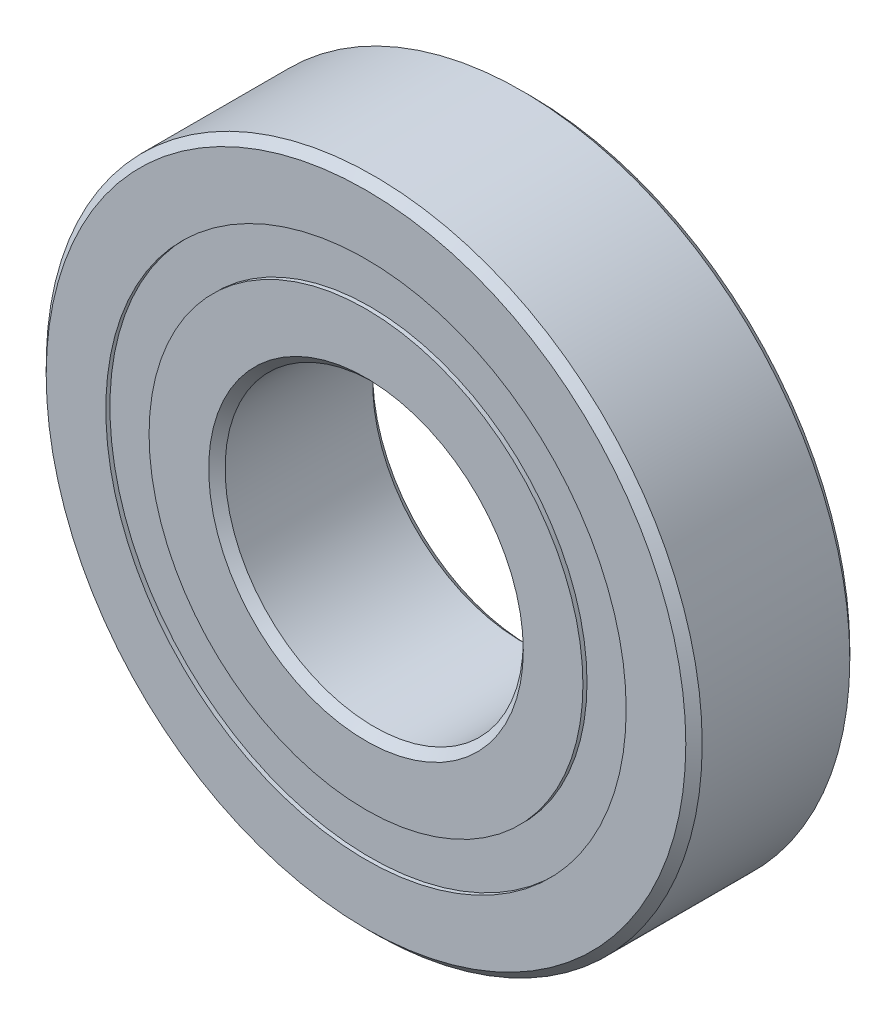
ISO-10303-21;
HEADER;
FILE_DESCRIPTION(('STEP AP214'),'2;1');
FILE_NAME('part.step','',(''),(''),'','','');
FILE_SCHEMA(('AUTOMOTIVE_DESIGN { 1 0 10303 214 1 1 1 1 }'));
ENDSEC;
DATA;
#1=APPLICATION_CONTEXT('core data for automotive mechanical design processes');
#2=APPLICATION_PROTOCOL_DEFINITION('international standard','automotive_design',2000,#1);
#3=PRODUCT_CONTEXT('',#1,'mechanical');
#4=PRODUCT('Part','Part','',(#3));
#5=PRODUCT_RELATED_PRODUCT_CATEGORY('part','',(#4));
#6=PRODUCT_DEFINITION_FORMATION('','',#4);
#7=PRODUCT_DEFINITION_CONTEXT('part definition',#1,'design');
#8=PRODUCT_DEFINITION('design','',#6,#7);
#9=PRODUCT_DEFINITION_SHAPE('','',#8);
#10=(LENGTH_UNIT() NAMED_UNIT(*) SI_UNIT(.MILLI.,.METRE.));
#11=(NAMED_UNIT(*) PLANE_ANGLE_UNIT() SI_UNIT($,.RADIAN.));
#12=(NAMED_UNIT(*) SI_UNIT($,.STERADIAN.) SOLID_ANGLE_UNIT());
#13=UNCERTAINTY_MEASURE_WITH_UNIT(LENGTH_MEASURE(1.E-05),#10,'distance_accuracy_value','');
#14=(GEOMETRIC_REPRESENTATION_CONTEXT(3) GLOBAL_UNCERTAINTY_ASSIGNED_CONTEXT((#13)) GLOBAL_UNIT_ASSIGNED_CONTEXT((#10,
#11,#12)) REPRESENTATION_CONTEXT('',''));
#15=CARTESIAN_POINT('',(0.,0.,0.));
#16=DIRECTION('',(0.,0.,1.));
#17=DIRECTION('',(1.,0.,0.));
#18=AXIS2_PLACEMENT_3D('',#15,#16,#17);
#19=CARTESIAN_POINT('',(0.,13.8513736263736,-4.14734375));
#20=DIRECTION('',(0.,0.,1.));
#21=DIRECTION('',(1.,0.,0.));
#22=AXIS2_PLACEMENT_3D('',#19,#20,#21);
#23=PLANE('',#22);
#24=CARTESIAN_POINT('',(0.,0.,-4.14734375));
#25=DIRECTION('',(0.,0.,1.));
#26=DIRECTION('',(1.,0.,0.));
#27=AXIS2_PLACEMENT_3D('',#24,#25,#26);
#28=CIRCLE('',#27,13.8513736263736);
#29=CARTESIAN_POINT('',(13.8513736263736,0.,-4.14734375));
#30=VERTEX_POINT('',#29);
#31=EDGE_CURVE('E60',#30,#30,#28,.T.);
#32=ORIENTED_EDGE('',*,*,#31,.F.);
#33=EDGE_LOOP('',(#32));
#34=FACE_BOUND('',#33,.T.);
#35=CARTESIAN_POINT('',(0.,0.,-4.14734375));
#36=DIRECTION('',(0.,0.,1.));
#37=DIRECTION('',(1.,0.,0.));
#38=AXIS2_PLACEMENT_3D('',#35,#36,#37);
#39=CIRCLE('',#38,11.5486263736264);
#40=CARTESIAN_POINT('',(11.5486263736264,0.,-4.14734375));
#41=VERTEX_POINT('',#40);
#42=EDGE_CURVE('E11',#41,#41,#39,.T.);
#43=ORIENTED_EDGE('',*,*,#42,.T.);
#44=EDGE_LOOP('',(#43));
#45=FACE_BOUND('',#44,.T.);
#46=ADVANCED_FACE('F46',(#34,#45),#23,.F.);
#47=CARTESIAN_POINT('',(0.,0.,4.365625));
#48=DIRECTION('',(0.,0.,1.));
#49=DIRECTION('',(1.,0.,0.));
#50=AXIS2_PLACEMENT_3D('',#47,#48,#49);
#51=CYLINDRICAL_SURFACE('',#50,11.5486263736264);
#52=ORIENTED_EDGE('',*,*,#42,.F.);
#53=EDGE_LOOP('',(#52));
#54=FACE_BOUND('',#53,.T.);
#55=CARTESIAN_POINT('',(0.,0.,-2.25617798111032));
#56=DIRECTION('',(0.,0.,1.));
#57=DIRECTION('',(1.,0.,0.));
#58=AXIS2_PLACEMENT_3D('',#55,#56,#57);
#59=CIRCLE('',#58,11.5486263736264);
#60=CARTESIAN_POINT('',(11.5486263736264,0.,-2.25617798111032));
#61=VERTEX_POINT('',#60);
#62=EDGE_CURVE('E52',#61,#61,#59,.T.);
#63=ORIENTED_EDGE('',*,*,#62,.T.);
#64=EDGE_LOOP('',(#63));
#65=FACE_BOUND('',#64,.T.);
#66=ADVANCED_FACE('F69',(#54,#65),#51,.F.);
#67=CARTESIAN_POINT('',(0.,13.8513736263736,-2.25617798111032));
#68=DIRECTION('',(0.,0.,-1.));
#69=DIRECTION('',(-1.,0.,0.));
#70=AXIS2_PLACEMENT_3D('',#67,#68,#69);
#71=PLANE('',#70);
#72=ORIENTED_EDGE('',*,*,#62,.F.);
#73=EDGE_LOOP('',(#72));
#74=FACE_BOUND('',#73,.T.);
#75=CARTESIAN_POINT('',(0.,0.,-2.25617798111032));
#76=DIRECTION('',(0.,0.,1.));
#77=DIRECTION('',(1.,0.,0.));
#78=AXIS2_PLACEMENT_3D('',#75,#76,#77);
#79=CIRCLE('',#78,13.8513736263736);
#80=CARTESIAN_POINT('',(13.8513736263736,0.,-2.25617798111032));
#81=VERTEX_POINT('',#80);
#82=EDGE_CURVE('E56',#81,#81,#79,.T.);
#83=ORIENTED_EDGE('',*,*,#82,.T.);
#84=EDGE_LOOP('',(#83));
#85=FACE_BOUND('',#84,.T.);
#86=ADVANCED_FACE('F73',(#74,#85),#71,.F.);
#87=CARTESIAN_POINT('',(0.,0.,4.365625));
#88=DIRECTION('',(0.,0.,1.));
#89=DIRECTION('',(1.,0.,0.));
#90=AXIS2_PLACEMENT_3D('',#87,#88,#89);
#91=CYLINDRICAL_SURFACE('',#90,13.8513736263736);
#92=ORIENTED_EDGE('',*,*,#82,.F.);
#93=EDGE_LOOP('',(#92));
#94=FACE_BOUND('',#93,.T.);
#95=ORIENTED_EDGE('',*,*,#31,.T.);
#96=EDGE_LOOP('',(#95));
#97=FACE_BOUND('',#96,.T.);
#98=ADVANCED_FACE('F66',(#94,#97),#91,.T.);
#99=CLOSED_SHELL('',(#46,#66,#86,#98));
#100=MANIFOLD_SOLID_BREP('B2',#99);
#101=CARTESIAN_POINT('',(0.,13.8513736263736,4.14734375));
#102=DIRECTION('',(0.,0.,-1.));
#103=DIRECTION('',(-1.,0.,0.));
#104=AXIS2_PLACEMENT_3D('',#101,#102,#103);
#105=PLANE('',#104);
#106=CARTESIAN_POINT('',(0.,0.,4.14734375));
#107=DIRECTION('',(0.,0.,1.));
#108=DIRECTION('',(1.,0.,0.));
#109=AXIS2_PLACEMENT_3D('',#106,#107,#108);
#110=CIRCLE('',#109,11.5486263736264);
#111=CARTESIAN_POINT('',(11.5486263736264,0.,4.14734375));
#112=VERTEX_POINT('',#111);
#113=EDGE_CURVE('E45',#112,#112,#110,.T.);
#114=ORIENTED_EDGE('',*,*,#113,.F.);
#115=EDGE_LOOP('',(#114));
#116=FACE_BOUND('',#115,.T.);
#117=CARTESIAN_POINT('',(0.,0.,4.14734375));
#118=DIRECTION('',(0.,0.,1.));
#119=DIRECTION('',(1.,0.,0.));
#120=AXIS2_PLACEMENT_3D('',#117,#118,#119);
#121=CIRCLE('',#120,13.8513736263736);
#122=CARTESIAN_POINT('',(13.8513736263736,0.,4.14734375));
#123=VERTEX_POINT('',#122);
#124=EDGE_CURVE('E128',#123,#123,#121,.T.);
#125=ORIENTED_EDGE('',*,*,#124,.T.);
#126=EDGE_LOOP('',(#125));
#127=FACE_BOUND('',#126,.T.);
#128=ADVANCED_FACE('F114',(#116,#127),#105,.F.);
#129=CARTESIAN_POINT('',(0.,0.,4.365625));
#130=DIRECTION('',(0.,0.,1.));
#131=DIRECTION('',(1.,0.,0.));
#132=AXIS2_PLACEMENT_3D('',#129,#130,#131);
#133=CYLINDRICAL_SURFACE('',#132,11.5486263736264);
#134=CARTESIAN_POINT('',(0.,0.,2.25617798111032));
#135=DIRECTION('',(0.,0.,1.));
#136=DIRECTION('',(1.,0.,0.));
#137=AXIS2_PLACEMENT_3D('',#134,#135,#136);
#138=CIRCLE('',#137,11.5486263736264);
#139=CARTESIAN_POINT('',(11.5486263736264,0.,2.25617798111032));
#140=VERTEX_POINT('',#139);
#141=EDGE_CURVE('E120',#140,#140,#138,.T.);
#142=ORIENTED_EDGE('',*,*,#141,.F.);
#143=EDGE_LOOP('',(#142));
#144=FACE_BOUND('',#143,.T.);
#145=ORIENTED_EDGE('',*,*,#113,.T.);
#146=EDGE_LOOP('',(#145));
#147=FACE_BOUND('',#146,.T.);
#148=ADVANCED_FACE('F143',(#144,#147),#133,.F.);
#149=CARTESIAN_POINT('',(0.,13.8513736263736,2.25617798111032));
#150=DIRECTION('',(0.,0.,1.));
#151=DIRECTION('',(1.,0.,0.));
#152=AXIS2_PLACEMENT_3D('',#149,#150,#151);
#153=PLANE('',#152);
#154=CARTESIAN_POINT('',(0.,0.,2.25617798111032));
#155=DIRECTION('',(0.,0.,1.));
#156=DIRECTION('',(1.,0.,0.));
#157=AXIS2_PLACEMENT_3D('',#154,#155,#156);
#158=CIRCLE('',#157,13.8513736263736);
#159=CARTESIAN_POINT('',(13.8513736263736,0.,2.25617798111032));
#160=VERTEX_POINT('',#159);
#161=EDGE_CURVE('E124',#160,#160,#158,.T.);
#162=ORIENTED_EDGE('',*,*,#161,.F.);
#163=EDGE_LOOP('',(#162));
#164=FACE_BOUND('',#163,.T.);
#165=ORIENTED_EDGE('',*,*,#141,.T.);
#166=EDGE_LOOP('',(#165));
#167=FACE_BOUND('',#166,.T.);
#168=ADVANCED_FACE('F138',(#164,#167),#153,.F.);
#169=CARTESIAN_POINT('',(0.,0.,4.365625));
#170=DIRECTION('',(0.,0.,1.));
#171=DIRECTION('',(1.,0.,0.));
#172=AXIS2_PLACEMENT_3D('',#169,#170,#171);
#173=CYLINDRICAL_SURFACE('',#172,13.8513736263736);
#174=ORIENTED_EDGE('',*,*,#124,.F.);
#175=EDGE_LOOP('',(#174));
#176=FACE_BOUND('',#175,.T.);
#177=ORIENTED_EDGE('',*,*,#161,.T.);
#178=EDGE_LOOP('',(#177));
#179=FACE_BOUND('',#178,.T.);
#180=ADVANCED_FACE('F135',(#176,#179),#173,.T.);
#181=CLOSED_SHELL('',(#128,#148,#168,#180));
#182=MANIFOLD_SOLID_BREP('B6',#181);
#183=CARTESIAN_POINT('',(-7.46487270411427,10.2745158285619,0.));
#184=DIRECTION('',(0.,0.,1.));
#185=DIRECTION('',(-0.587785252292462,0.809016994374955,0.));
#186=AXIS2_PLACEMENT_3D('',#183,#184,#185);
#187=SPHERICAL_SURFACE('',#186,2.25617798111032);
#188=CARTESIAN_POINT('',(-7.46487270411427,10.2745158285619,2.25617798111032));
#189=VERTEX_POINT('',#188);
#190=VERTEX_LOOP('',#189);
#191=FACE_BOUND('',#190,.T.);
#192=ADVANCED_FACE('F181',(#191),#187,.T.);
#193=CLOSED_SHELL('',(#192));
#194=MANIFOLD_SOLID_BREP('B40',#193);
#195=CARTESIAN_POINT('',(-12.0784177569484,3.92451582856197,0.));
#196=DIRECTION('',(0.,0.,1.));
#197=DIRECTION('',(-0.95105651629515,0.309016994374958,0.));
#198=AXIS2_PLACEMENT_3D('',#195,#196,#197);
#199=SPHERICAL_SURFACE('',#198,2.25617798111032);
#200=CARTESIAN_POINT('',(-12.0784177569484,3.92451582856197,2.25617798111032));
#201=VERTEX_POINT('',#200);
#202=VERTEX_LOOP('',#201);
#203=FACE_BOUND('',#202,.T.);
#204=ADVANCED_FACE('F201',(#203),#199,.T.);
#205=CLOSED_SHELL('',(#204));
#206=MANIFOLD_SOLID_BREP('B110',#205);
#207=CARTESIAN_POINT('',(-12.0784177569485,-3.92451582856172,0.));
#208=DIRECTION('',(0.,0.,1.));
#209=DIRECTION('',(-0.951056516295157,-0.309016994374938,0.));
#210=AXIS2_PLACEMENT_3D('',#207,#208,#209);
#211=SPHERICAL_SURFACE('',#210,2.25617798111032);
#212=CARTESIAN_POINT('',(-12.0784177569485,-3.92451582856172,2.25617798111032));
#213=VERTEX_POINT('',#212);
#214=VERTEX_LOOP('',#213);
#215=FACE_BOUND('',#214,.T.);
#216=ADVANCED_FACE('F221',(#215),#211,.T.);
#217=CLOSED_SHELL('',(#216));
#218=MANIFOLD_SOLID_BREP('B177',#217);
#219=CARTESIAN_POINT('',(-7.4648727041145,-10.2745158285618,0.));
#220=DIRECTION('',(0.,0.,1.));
#221=DIRECTION('',(-0.58778525229248,-0.809016994374942,0.));
#222=AXIS2_PLACEMENT_3D('',#219,#220,#221);
#223=SPHERICAL_SURFACE('',#222,2.25617798111032);
#224=CARTESIAN_POINT('',(-7.4648727041145,-10.2745158285618,2.25617798111032));
#225=VERTEX_POINT('',#224);
#226=VERTEX_LOOP('',#225);
#227=FACE_BOUND('',#226,.T.);
#228=ADVANCED_FACE('F241',(#227),#223,.T.);
#229=CLOSED_SHELL('',(#228));
#230=MANIFOLD_SOLID_BREP('B197',#229);
#231=CARTESIAN_POINT('',(0.,-12.7,0.));
#232=DIRECTION('',(0.,0.,1.));
#233=DIRECTION('',(0.,-1.,0.));
#234=AXIS2_PLACEMENT_3D('',#231,#232,#233);
#235=SPHERICAL_SURFACE('',#234,2.25617798111032);
#236=CARTESIAN_POINT('',(0.,-12.7,2.25617798111032));
#237=VERTEX_POINT('',#236);
#238=VERTEX_LOOP('',#237);
#239=FACE_BOUND('',#238,.T.);
#240=ADVANCED_FACE('F261',(#239),#235,.T.);
#241=CLOSED_SHELL('',(#240));
#242=MANIFOLD_SOLID_BREP('B217',#241);
#243=CARTESIAN_POINT('',(7.46487270411435,-10.2745158285619,0.));
#244=DIRECTION('',(0.,0.,1.));
#245=DIRECTION('',(0.587785252292469,-0.809016994374951,0.));
#246=AXIS2_PLACEMENT_3D('',#243,#244,#245);
#247=SPHERICAL_SURFACE('',#246,2.25617798111032);
#248=CARTESIAN_POINT('',(7.46487270411435,-10.2745158285619,2.25617798111032));
#249=VERTEX_POINT('',#248);
#250=VERTEX_LOOP('',#249);
#251=FACE_BOUND('',#250,.T.);
#252=ADVANCED_FACE('F281',(#251),#247,.T.);
#253=CLOSED_SHELL('',(#252));
#254=MANIFOLD_SOLID_BREP('B237',#253);
#255=CARTESIAN_POINT('',(12.0784177569484,-3.92451582856189,0.));
#256=DIRECTION('',(0.,0.,1.));
#257=DIRECTION('',(0.951056516295152,-0.309016994374952,0.));
#258=AXIS2_PLACEMENT_3D('',#255,#256,#257);
#259=SPHERICAL_SURFACE('',#258,2.25617798111032);
#260=CARTESIAN_POINT('',(12.0784177569484,-3.92451582856189,2.25617798111032));
#261=VERTEX_POINT('',#260);
#262=VERTEX_LOOP('',#261);
#263=FACE_BOUND('',#262,.T.);
#264=ADVANCED_FACE('F301',(#263),#259,.T.);
#265=CLOSED_SHELL('',(#264));
#266=MANIFOLD_SOLID_BREP('B257',#265);
#267=CARTESIAN_POINT('',(12.0784177569485,3.9245158285618,0.));
#268=DIRECTION('',(0.,0.,1.));
#269=DIRECTION('',(0.951056516295155,0.309016994374945,0.));
#270=AXIS2_PLACEMENT_3D('',#267,#268,#269);
#271=SPHERICAL_SURFACE('',#270,2.25617798111032);
#272=CARTESIAN_POINT('',(12.0784177569485,3.9245158285618,2.25617798111032));
#273=VERTEX_POINT('',#272);
#274=VERTEX_LOOP('',#273);
#275=FACE_BOUND('',#274,.T.);
#276=ADVANCED_FACE('F321',(#275),#271,.T.);
#277=CLOSED_SHELL('',(#276));
#278=MANIFOLD_SOLID_BREP('B277',#277);
#279=CARTESIAN_POINT('',(7.46487270411442,10.2745158285618,0.));
#280=DIRECTION('',(0.,0.,1.));
#281=DIRECTION('',(0.587785252292474,0.809016994374947,0.));
#282=AXIS2_PLACEMENT_3D('',#279,#280,#281);
#283=SPHERICAL_SURFACE('',#282,2.25617798111032);
#284=CARTESIAN_POINT('',(7.46487270411442,10.2745158285618,2.25617798111032));
#285=VERTEX_POINT('',#284);
#286=VERTEX_LOOP('',#285);
#287=FACE_BOUND('',#286,.T.);
#288=ADVANCED_FACE('F341',(#287),#283,.T.);
#289=CLOSED_SHELL('',(#288));
#290=MANIFOLD_SOLID_BREP('B297',#289);
#291=CARTESIAN_POINT('',(0.,12.7,0.));
#292=DIRECTION('',(0.,0.,1.));
#293=DIRECTION('',(0.,1.,0.));
#294=AXIS2_PLACEMENT_3D('',#291,#292,#293);
#295=SPHERICAL_SURFACE('',#294,2.25617798111032);
#296=CARTESIAN_POINT('',(0.,12.7,2.25617798111032));
#297=VERTEX_POINT('',#296);
#298=VERTEX_LOOP('',#297);
#299=FACE_BOUND('',#298,.T.);
#300=ADVANCED_FACE('F364',(#299),#295,.T.);
#301=CLOSED_SHELL('',(#300));
#302=MANIFOLD_SOLID_BREP('B317',#301);
#303=CARTESIAN_POINT('',(0.,11.5486263736264,4.365625));
#304=DIRECTION('',(0.,0.,-1.));
#305=DIRECTION('',(-1.,0.,0.));
#306=AXIS2_PLACEMENT_3D('',#303,#304,#305);
#307=PLANE('',#306);
#308=CARTESIAN_POINT('',(0.,0.,4.365625));
#309=DIRECTION('',(0.,0.,1.));
#310=DIRECTION('',(1.,0.,0.));
#311=AXIS2_PLACEMENT_3D('',#308,#309,#310);
#312=CIRCLE('',#311,8.3740625);
#313=CARTESIAN_POINT('',(8.3740625,0.,4.365625));
#314=VERTEX_POINT('',#313);
#315=EDGE_CURVE('E412',#314,#314,#312,.T.);
#316=ORIENTED_EDGE('',*,*,#315,.F.);
#317=EDGE_LOOP('',(#316));
#318=FACE_BOUND('',#317,.T.);
#319=CARTESIAN_POINT('',(0.,0.,4.365625));
#320=DIRECTION('',(0.,0.,1.));
#321=DIRECTION('',(1.,0.,0.));
#322=AXIS2_PLACEMENT_3D('',#319,#320,#321);
#323=CIRCLE('',#322,11.5486263736264);
#324=CARTESIAN_POINT('',(11.5486263736264,0.,4.365625));
#325=VERTEX_POINT('',#324);
#326=EDGE_CURVE('E363',#325,#325,#323,.T.);
#327=ORIENTED_EDGE('',*,*,#326,.T.);
#328=EDGE_LOOP('',(#327));
#329=FACE_BOUND('',#328,.T.);
#330=ADVANCED_FACE('F384',(#318,#329),#307,.F.);
#331=CARTESIAN_POINT('',(0.,0.,4.365625));
#332=DIRECTION('',(0.,0.,1.));
#333=DIRECTION('',(1.,0.,0.));
#334=AXIS2_PLACEMENT_3D('',#331,#332,#333);
#335=CYLINDRICAL_SURFACE('',#334,11.5486263736264);
#336=ORIENTED_EDGE('',*,*,#326,.F.);
#337=EDGE_LOOP('',(#336));
#338=FACE_BOUND('',#337,.T.);
#339=CARTESIAN_POINT('',(0.,0.,1.94027777777778));
#340=DIRECTION('',(0.,0.,1.));
#341=DIRECTION('',(1.,0.,0.));
#342=AXIS2_PLACEMENT_3D('',#339,#340,#341);
#343=CIRCLE('',#342,11.5486263736264);
#344=CARTESIAN_POINT('',(11.5486263736264,0.,1.94027777777778));
#345=VERTEX_POINT('',#344);
#346=EDGE_CURVE('E390',#345,#345,#343,.T.);
#347=ORIENTED_EDGE('',*,*,#346,.T.);
#348=EDGE_LOOP('',(#347));
#349=FACE_BOUND('',#348,.T.);
#350=ADVANCED_FACE('F419',(#338,#349),#335,.T.);
#351=CARTESIAN_POINT('',(0.,0.,0.));
#352=DIRECTION('',(0.,0.,1.));
#353=DIRECTION('',(1.,0.,0.));
#354=AXIS2_PLACEMENT_3D('',#351,#352,#353);
#355=TOROIDAL_SURFACE('',#354,12.7,2.25617798111031);
#356=ORIENTED_EDGE('',*,*,#346,.F.);
#357=EDGE_LOOP('',(#356));
#358=FACE_BOUND('',#357,.T.);
#359=CARTESIAN_POINT('',(0.,0.,-1.94027777777778));
#360=DIRECTION('',(0.,0.,1.));
#361=DIRECTION('',(1.,0.,0.));
#362=AXIS2_PLACEMENT_3D('',#359,#360,#361);
#363=CIRCLE('',#362,11.5486263736264);
#364=CARTESIAN_POINT('',(11.5486263736264,0.,-1.94027777777778));
#365=VERTEX_POINT('',#364);
#366=EDGE_CURVE('E394',#365,#365,#363,.T.);
#367=ORIENTED_EDGE('',*,*,#366,.T.);
#368=EDGE_LOOP('',(#367));
#369=FACE_BOUND('',#368,.T.);
#370=ADVANCED_FACE('F423',(#358,#369),#355,.F.);
#371=CARTESIAN_POINT('',(0.,0.,4.365625));
#372=DIRECTION('',(0.,0.,1.));
#373=DIRECTION('',(1.,0.,0.));
#374=AXIS2_PLACEMENT_3D('',#371,#372,#373);
#375=CYLINDRICAL_SURFACE('',#374,11.5486263736264);
#376=ORIENTED_EDGE('',*,*,#366,.F.);
#377=EDGE_LOOP('',(#376));
#378=FACE_BOUND('',#377,.T.);
#379=CARTESIAN_POINT('',(0.,0.,-4.365625));
#380=DIRECTION('',(0.,0.,1.));
#381=DIRECTION('',(1.,0.,0.));
#382=AXIS2_PLACEMENT_3D('',#379,#380,#381);
#383=CIRCLE('',#382,11.5486263736264);
#384=CARTESIAN_POINT('',(11.5486263736264,0.,-4.365625));
#385=VERTEX_POINT('',#384);
#386=EDGE_CURVE('E398',#385,#385,#383,.T.);
#387=ORIENTED_EDGE('',*,*,#386,.T.);
#388=EDGE_LOOP('',(#387));
#389=FACE_BOUND('',#388,.T.);
#390=ADVANCED_FACE('F428',(#378,#389),#375,.T.);
#391=CARTESIAN_POINT('',(0.,8.3740625,-4.365625));
#392=DIRECTION('',(0.,0.,1.));
#393=DIRECTION('',(1.,0.,0.));
#394=AXIS2_PLACEMENT_3D('',#391,#392,#393);
#395=PLANE('',#394);
#396=ORIENTED_EDGE('',*,*,#386,.F.);
#397=EDGE_LOOP('',(#396));
#398=FACE_BOUND('',#397,.T.);
#399=CARTESIAN_POINT('',(0.,0.,-4.365625));
#400=DIRECTION('',(0.,0.,1.));
#401=DIRECTION('',(1.,0.,0.));
#402=AXIS2_PLACEMENT_3D('',#399,#400,#401);
#403=CIRCLE('',#402,8.3740625);
#404=CARTESIAN_POINT('',(8.3740625,0.,-4.365625));
#405=VERTEX_POINT('',#404);
#406=EDGE_CURVE('E403',#405,#405,#403,.T.);
#407=ORIENTED_EDGE('',*,*,#406,.T.);
#408=EDGE_LOOP('',(#407));
#409=FACE_BOUND('',#408,.T.);
#410=ADVANCED_FACE('F434',(#398,#409),#395,.F.);
#411=CARTESIAN_POINT('',(0.,0.,-3.9290625));
#412=DIRECTION('',(0.,0.,-1.));
#413=DIRECTION('',(-1.,0.,0.));
#414=AXIS2_PLACEMENT_3D('',#411,#412,#413);
#415=CONICAL_SURFACE('',#414,7.9375,0.785398163397446);
#416=ORIENTED_EDGE('',*,*,#406,.F.);
#417=EDGE_LOOP('',(#416));
#418=FACE_BOUND('',#417,.T.);
#419=CARTESIAN_POINT('',(0.,0.,-3.9290625));
#420=DIRECTION('',(0.,0.,1.));
#421=DIRECTION('',(1.,0.,0.));
#422=AXIS2_PLACEMENT_3D('',#419,#420,#421);
#423=CIRCLE('',#422,7.9375);
#424=CARTESIAN_POINT('',(7.9375,0.,-3.9290625));
#425=VERTEX_POINT('',#424);
#426=EDGE_CURVE('E406',#425,#425,#423,.T.);
#427=ORIENTED_EDGE('',*,*,#426,.T.);
#428=EDGE_LOOP('',(#427));
#429=FACE_BOUND('',#428,.T.);
#430=ADVANCED_FACE('F438',(#418,#429),#415,.F.);
#431=CARTESIAN_POINT('',(0.,0.,4.365625));
#432=DIRECTION('',(0.,0.,1.));
#433=DIRECTION('',(1.,0.,0.));
#434=AXIS2_PLACEMENT_3D('',#431,#432,#433);
#435=CYLINDRICAL_SURFACE('',#434,7.9375);
#436=ORIENTED_EDGE('',*,*,#426,.F.);
#437=EDGE_LOOP('',(#436));
#438=FACE_BOUND('',#437,.T.);
#439=CARTESIAN_POINT('',(0.,0.,3.9290625));
#440=DIRECTION('',(0.,0.,1.));
#441=DIRECTION('',(1.,0.,0.));
#442=AXIS2_PLACEMENT_3D('',#439,#440,#441);
#443=CIRCLE('',#442,7.9375);
#444=CARTESIAN_POINT('',(7.9375,0.,3.9290625));
#445=VERTEX_POINT('',#444);
#446=EDGE_CURVE('E409',#445,#445,#443,.T.);
#447=ORIENTED_EDGE('',*,*,#446,.T.);
#448=EDGE_LOOP('',(#447));
#449=FACE_BOUND('',#448,.T.);
#450=ADVANCED_FACE('F442',(#438,#449),#435,.F.);
#451=CARTESIAN_POINT('',(0.,0.,4.365625));
#452=DIRECTION('',(0.,0.,1.));
#453=DIRECTION('',(1.,0.,0.));
#454=AXIS2_PLACEMENT_3D('',#451,#452,#453);
#455=CONICAL_SURFACE('',#454,8.3740625,0.78539816339745);
#456=ORIENTED_EDGE('',*,*,#446,.F.);
#457=EDGE_LOOP('',(#456));
#458=FACE_BOUND('',#457,.T.);
#459=ORIENTED_EDGE('',*,*,#315,.T.);
#460=EDGE_LOOP('',(#459));
#461=FACE_BOUND('',#460,.T.);
#462=ADVANCED_FACE('F416',(#458,#461),#455,.F.);
#463=CLOSED_SHELL('',(#330,#350,#370,#390,#410,#430,#450,#462));
#464=MANIFOLD_SOLID_BREP('B337',#463);
#465=CARTESIAN_POINT('',(0.,0.,3.9290625));
#466=DIRECTION('',(0.,0.,-1.));
#467=DIRECTION('',(-1.,0.,0.));
#468=AXIS2_PLACEMENT_3D('',#465,#466,#467);
#469=CONICAL_SURFACE('',#468,17.4625,0.785398163397445);
#470=CARTESIAN_POINT('',(0.,0.,4.365625));
#471=DIRECTION('',(0.,0.,1.));
#472=DIRECTION('',(1.,0.,0.));
#473=AXIS2_PLACEMENT_3D('',#470,#471,#472);
#474=CIRCLE('',#473,17.0259375);
#475=CARTESIAN_POINT('',(17.0259375,0.,4.365625));
#476=VERTEX_POINT('',#475);
#477=EDGE_CURVE('E534',#476,#476,#474,.T.);
#478=ORIENTED_EDGE('',*,*,#477,.F.);
#479=EDGE_LOOP('',(#478));
#480=FACE_BOUND('',#479,.T.);
#481=CARTESIAN_POINT('',(0.,0.,3.9290625));
#482=DIRECTION('',(0.,0.,1.));
#483=DIRECTION('',(1.,0.,0.));
#484=AXIS2_PLACEMENT_3D('',#481,#482,#483);
#485=CIRCLE('',#484,17.4625);
#486=CARTESIAN_POINT('',(17.4625,0.,3.9290625));
#487=VERTEX_POINT('',#486);
#488=EDGE_CURVE('E383',#487,#487,#485,.T.);
#489=ORIENTED_EDGE('',*,*,#488,.T.);
#490=EDGE_LOOP('',(#489));
#491=FACE_BOUND('',#490,.T.);
#492=ADVANCED_FACE('F506',(#480,#491),#469,.T.);
#493=CARTESIAN_POINT('',(0.,0.,4.365625));
#494=DIRECTION('',(0.,0.,1.));
#495=DIRECTION('',(1.,0.,0.));
#496=AXIS2_PLACEMENT_3D('',#493,#494,#495);
#497=CYLINDRICAL_SURFACE('',#496,17.4625);
#498=ORIENTED_EDGE('',*,*,#488,.F.);
#499=EDGE_LOOP('',(#498));
#500=FACE_BOUND('',#499,.T.);
#501=CARTESIAN_POINT('',(0.,0.,-3.9290625));
#502=DIRECTION('',(0.,0.,1.));
#503=DIRECTION('',(1.,0.,0.));
#504=AXIS2_PLACEMENT_3D('',#501,#502,#503);
#505=CIRCLE('',#504,17.4625);
#506=CARTESIAN_POINT('',(17.4625,0.,-3.9290625));
#507=VERTEX_POINT('',#506);
#508=EDGE_CURVE('E512',#507,#507,#505,.T.);
#509=ORIENTED_EDGE('',*,*,#508,.T.);
#510=EDGE_LOOP('',(#509));
#511=FACE_BOUND('',#510,.T.);
#512=ADVANCED_FACE('F541',(#500,#511),#497,.T.);
#513=CARTESIAN_POINT('',(0.,0.,-4.365625));
#514=DIRECTION('',(0.,0.,1.));
#515=DIRECTION('',(1.,0.,0.));
#516=AXIS2_PLACEMENT_3D('',#513,#514,#515);
#517=CONICAL_SURFACE('',#516,17.0259375,0.785398163397446);
#518=ORIENTED_EDGE('',*,*,#508,.F.);
#519=EDGE_LOOP('',(#518));
#520=FACE_BOUND('',#519,.T.);
#521=CARTESIAN_POINT('',(0.,0.,-4.365625));
#522=DIRECTION('',(0.,0.,1.));
#523=DIRECTION('',(1.,0.,0.));
#524=AXIS2_PLACEMENT_3D('',#521,#522,#523);
#525=CIRCLE('',#524,17.0259375);
#526=CARTESIAN_POINT('',(17.0259375,0.,-4.365625));
#527=VERTEX_POINT('',#526);
#528=EDGE_CURVE('E516',#527,#527,#525,.T.);
#529=ORIENTED_EDGE('',*,*,#528,.T.);
#530=EDGE_LOOP('',(#529));
#531=FACE_BOUND('',#530,.T.);
#532=ADVANCED_FACE('F545',(#520,#531),#517,.T.);
#533=CARTESIAN_POINT('',(0.,17.0259375,-4.365625));
#534=DIRECTION('',(0.,0.,1.));
#535=DIRECTION('',(1.,0.,0.));
#536=AXIS2_PLACEMENT_3D('',#533,#534,#535);
#537=PLANE('',#536);
#538=ORIENTED_EDGE('',*,*,#528,.F.);
#539=EDGE_LOOP('',(#538));
#540=FACE_BOUND('',#539,.T.);
#541=CARTESIAN_POINT('',(0.,0.,-4.365625));
#542=DIRECTION('',(0.,0.,1.));
#543=DIRECTION('',(1.,0.,0.));
#544=AXIS2_PLACEMENT_3D('',#541,#542,#543);
#545=CIRCLE('',#544,13.8513736263736);
#546=CARTESIAN_POINT('',(13.8513736263736,0.,-4.365625));
#547=VERTEX_POINT('',#546);
#548=EDGE_CURVE('E520',#547,#547,#545,.T.);
#549=ORIENTED_EDGE('',*,*,#548,.T.);
#550=EDGE_LOOP('',(#549));
#551=FACE_BOUND('',#550,.T.);
#552=ADVANCED_FACE('F550',(#540,#551),#537,.F.);
#553=CARTESIAN_POINT('',(0.,0.,4.365625));
#554=DIRECTION('',(0.,0.,1.));
#555=DIRECTION('',(1.,0.,0.));
#556=AXIS2_PLACEMENT_3D('',#553,#554,#555);
#557=CYLINDRICAL_SURFACE('',#556,13.8513736263736);
#558=ORIENTED_EDGE('',*,*,#548,.F.);
#559=EDGE_LOOP('',(#558));
#560=FACE_BOUND('',#559,.T.);
#561=CARTESIAN_POINT('',(0.,0.,-1.94027777777778));
#562=DIRECTION('',(0.,0.,1.));
#563=DIRECTION('',(1.,0.,0.));
#564=AXIS2_PLACEMENT_3D('',#561,#562,#563);
#565=CIRCLE('',#564,13.8513736263736);
#566=CARTESIAN_POINT('',(13.8513736263736,0.,-1.94027777777778));
#567=VERTEX_POINT('',#566);
#568=EDGE_CURVE('E525',#567,#567,#565,.T.);
#569=ORIENTED_EDGE('',*,*,#568,.T.);
#570=EDGE_LOOP('',(#569));
#571=FACE_BOUND('',#570,.T.);
#572=ADVANCED_FACE('F556',(#560,#571),#557,.F.);
#573=CARTESIAN_POINT('',(0.,0.,0.));
#574=DIRECTION('',(0.,0.,1.));
#575=DIRECTION('',(1.,0.,0.));
#576=AXIS2_PLACEMENT_3D('',#573,#574,#575);
#577=TOROIDAL_SURFACE('',#576,12.7,2.25617798111032);
#578=ORIENTED_EDGE('',*,*,#568,.F.);
#579=EDGE_LOOP('',(#578));
#580=FACE_BOUND('',#579,.T.);
#581=CARTESIAN_POINT('',(0.,0.,1.94027777777778));
#582=DIRECTION('',(0.,0.,1.));
#583=DIRECTION('',(1.,0.,0.));
#584=AXIS2_PLACEMENT_3D('',#581,#582,#583);
#585=CIRCLE('',#584,13.8513736263736);
#586=CARTESIAN_POINT('',(13.8513736263736,0.,1.94027777777778));
#587=VERTEX_POINT('',#586);
#588=EDGE_CURVE('E528',#587,#587,#585,.T.);
#589=ORIENTED_EDGE('',*,*,#588,.T.);
#590=EDGE_LOOP('',(#589));
#591=FACE_BOUND('',#590,.T.);
#592=ADVANCED_FACE('F560',(#580,#591),#577,.F.);
#593=CARTESIAN_POINT('',(0.,0.,4.365625));
#594=DIRECTION('',(0.,0.,1.));
#595=DIRECTION('',(1.,0.,0.));
#596=AXIS2_PLACEMENT_3D('',#593,#594,#595);
#597=CYLINDRICAL_SURFACE('',#596,13.8513736263736);
#598=ORIENTED_EDGE('',*,*,#588,.F.);
#599=EDGE_LOOP('',(#598));
#600=FACE_BOUND('',#599,.T.);
#601=CARTESIAN_POINT('',(0.,0.,4.365625));
#602=DIRECTION('',(0.,0.,1.));
#603=DIRECTION('',(1.,0.,0.));
#604=AXIS2_PLACEMENT_3D('',#601,#602,#603);
#605=CIRCLE('',#604,13.8513736263736);
#606=CARTESIAN_POINT('',(13.8513736263736,0.,4.365625));
#607=VERTEX_POINT('',#606);
#608=EDGE_CURVE('E531',#607,#607,#605,.T.);
#609=ORIENTED_EDGE('',*,*,#608,.T.);
#610=EDGE_LOOP('',(#609));
#611=FACE_BOUND('',#610,.T.);
#612=ADVANCED_FACE('F564',(#600,#611),#597,.F.);
#613=CARTESIAN_POINT('',(0.,17.0259375,4.365625));
#614=DIRECTION('',(0.,0.,-1.));
#615=DIRECTION('',(-1.,0.,0.));
#616=AXIS2_PLACEMENT_3D('',#613,#614,#615);
#617=PLANE('',#616);
#618=ORIENTED_EDGE('',*,*,#608,.F.);
#619=EDGE_LOOP('',(#618));
#620=FACE_BOUND('',#619,.T.);
#621=ORIENTED_EDGE('',*,*,#477,.T.);
#622=EDGE_LOOP('',(#621));
#623=FACE_BOUND('',#622,.T.);
#624=ADVANCED_FACE('F538',(#620,#623),#617,.F.);
#625=CLOSED_SHELL('',(#492,#512,#532,#552,#572,#592,#612,#624));
#626=MANIFOLD_SOLID_BREP('B358',#625);
#627=ADVANCED_BREP_SHAPE_REPRESENTATION('',(#18,#100,#182,#194,#206,#218,#230,#242,#254,#266,
#278,#290,#302,#464,#626),#14);
#628=SHAPE_DEFINITION_REPRESENTATION(#9,#627);
ENDSEC;
END-ISO-10303-21;
